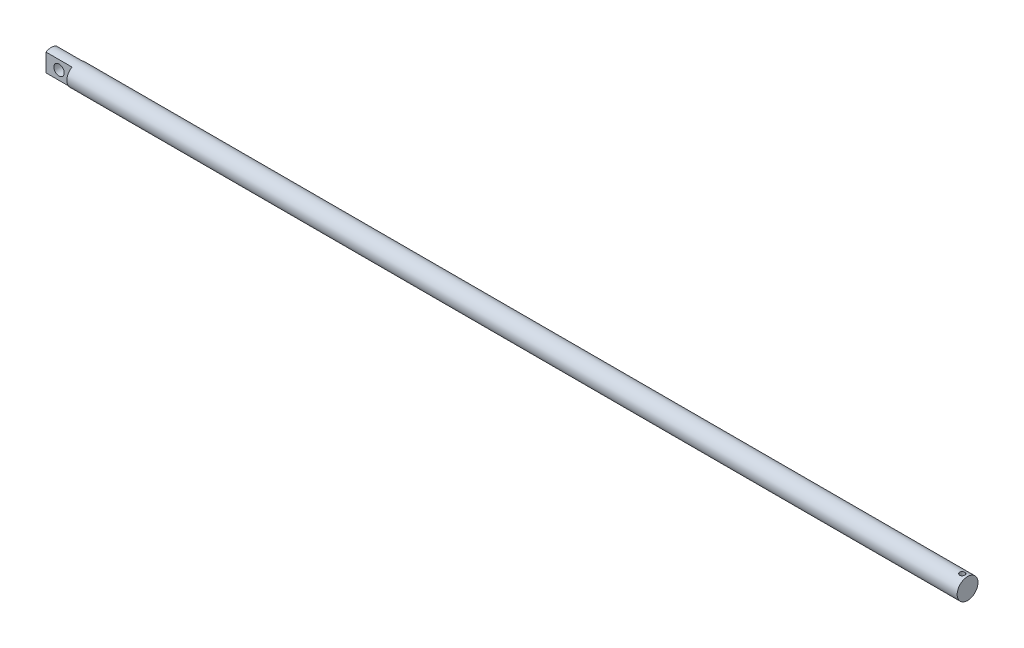
ISO-10303-21;
HEADER;
FILE_DESCRIPTION(('STEP AP214'),'2;1');
FILE_NAME('part.step','',(''),(''),'','','');
FILE_SCHEMA(('AUTOMOTIVE_DESIGN { 1 0 10303 214 1 1 1 1 }'));
ENDSEC;
DATA;
#1=APPLICATION_CONTEXT('core data for automotive mechanical design processes');
#2=APPLICATION_PROTOCOL_DEFINITION('international standard','automotive_design',2000,#1);
#3=PRODUCT_CONTEXT('',#1,'mechanical');
#4=PRODUCT('Part','Part','',(#3));
#5=PRODUCT_RELATED_PRODUCT_CATEGORY('part','',(#4));
#6=PRODUCT_DEFINITION_FORMATION('','',#4);
#7=PRODUCT_DEFINITION_CONTEXT('part definition',#1,'design');
#8=PRODUCT_DEFINITION('design','',#6,#7);
#9=PRODUCT_DEFINITION_SHAPE('','',#8);
#10=(LENGTH_UNIT() NAMED_UNIT(*) SI_UNIT(.MILLI.,.METRE.));
#11=(NAMED_UNIT(*) PLANE_ANGLE_UNIT() SI_UNIT($,.RADIAN.));
#12=(NAMED_UNIT(*) SI_UNIT($,.STERADIAN.) SOLID_ANGLE_UNIT());
#13=UNCERTAINTY_MEASURE_WITH_UNIT(LENGTH_MEASURE(1.E-05),#10,'distance_accuracy_value','');
#14=(GEOMETRIC_REPRESENTATION_CONTEXT(3) GLOBAL_UNCERTAINTY_ASSIGNED_CONTEXT((#13)) GLOBAL_UNIT_ASSIGNED_CONTEXT((#10,
#11,#12)) REPRESENTATION_CONTEXT('',''));
#15=CARTESIAN_POINT('',(0.,0.,0.));
#16=DIRECTION('',(0.,0.,1.));
#17=DIRECTION('',(1.,0.,0.));
#18=AXIS2_PLACEMENT_3D('',#15,#16,#17);
#19=CARTESIAN_POINT('',(703.5,0.,0.));
#20=DIRECTION('',(-1.,0.,0.));
#21=DIRECTION('',(0.,0.,1.));
#22=AXIS2_PLACEMENT_3D('',#19,#20,#21);
#23=CYLINDRICAL_SURFACE('',#22,8.);
#24=CARTESIAN_POINT('',(699.5,-7.74596669241483,2.));
#25=CARTESIAN_POINT('',(699.610440600741,-7.74596880070288,1.99999686287446));
#26=CARTESIAN_POINT('',(699.720915918943,-7.74835444811678,1.99082099639812));
#27=CARTESIAN_POINT('',(699.938694062539,-7.75761489594051,1.95441850037102));
#28=CARTESIAN_POINT('',(700.045995003575,-7.76449230897304,1.92718136539367));
#29=CARTESIAN_POINT('',(700.25424283055,-7.78190979676921,1.85559295970561));
#30=CARTESIAN_POINT('',(700.355197724309,-7.79244514152367,1.81126378228358));
#31=CARTESIAN_POINT('',(700.548248682032,-7.81598553623007,1.70681691300909));
#32=CARTESIAN_POINT('',(700.640344369664,-7.82899069102792,1.64669855084853));
#33=CARTESIAN_POINT('',(700.81508931621,-7.856325730845,1.51096674184948));
#34=CARTESIAN_POINT('',(700.89751488028,-7.87067678098428,1.43506951016321));
#35=CARTESIAN_POINT('',(701.048609115488,-7.89890300412235,1.2705456512805));
#36=CARTESIAN_POINT('',(701.117276500497,-7.91277813253111,1.18191783534422));
#37=CARTESIAN_POINT('',(701.239820374105,-7.93872332416467,0.992916160863108));
#38=CARTESIAN_POINT('',(701.293477110529,-7.95076549920475,0.892395660956012));
#39=CARTESIAN_POINT('',(701.383047715323,-7.97144649540788,0.683410547434112));
#40=CARTESIAN_POINT('',(701.418964201532,-7.98008581867476,0.57494710863347));
#41=CARTESIAN_POINT('',(701.471318267663,-7.99283807078545,0.355487007003265));
#42=CARTESIAN_POINT('',(701.488135715461,-7.99703915075452,0.244586175639118));
#43=CARTESIAN_POINT('',(701.503006703421,-8.00074875285838,0.0214630554101571));
#44=CARTESIAN_POINT('',(701.501063017768,-8.00025796877363,-0.090759035630511));
#45=CARTESIAN_POINT('',(701.4787401198,-7.99470475962828,-0.310704494344816));
#46=CARTESIAN_POINT('',(701.458770939957,-7.98974401872699,-0.418472431202162));
#47=CARTESIAN_POINT('',(701.401622983961,-7.97592669219883,-0.629076494827399));
#48=CARTESIAN_POINT('',(701.364443291698,-7.96706989918752,-0.731912358740913));
#49=CARTESIAN_POINT('',(701.27359794345,-7.94630007760716,-0.930813407003668));
#50=CARTESIAN_POINT('',(701.21978636427,-7.93436015756042,-1.02680901953307));
#51=CARTESIAN_POINT('',(701.097315456707,-7.90871923047719,-1.20855124468102));
#52=CARTESIAN_POINT('',(701.028653545151,-7.89501791721992,-1.29429607017104));
#53=CARTESIAN_POINT('',(700.876233006414,-7.86690971015616,-1.45554807016992));
#54=CARTESIAN_POINT('',(700.792116086122,-7.85249375620734,-1.53071535815041));
#55=CARTESIAN_POINT('',(700.612320021168,-7.82492034813365,-1.66595275192605));
#56=CARTESIAN_POINT('',(700.516640336407,-7.81176295284776,-1.72602215209205));
#57=CARTESIAN_POINT('',(700.315767972681,-7.78816397465319,-1.8295762580452));
#58=CARTESIAN_POINT('',(700.21053141575,-7.77773586980577,-1.87297913394097));
#59=CARTESIAN_POINT('',(699.993931625539,-7.76094912111966,-1.94137124127267));
#60=CARTESIAN_POINT('',(699.882569708814,-7.75458960648175,-1.96636441310581));
#61=CARTESIAN_POINT('',(699.660032398782,-7.74684284831313,-1.99666371093212));
#62=CARTESIAN_POINT('',(699.548929765336,-7.74532871274919,-2.00247237913569));
#63=CARTESIAN_POINT('',(699.327342450738,-7.74709874784831,-1.99561359241245));
#64=CARTESIAN_POINT('',(699.216857713639,-7.75038247681012,-1.98294783827906));
#65=CARTESIAN_POINT('',(699.001508588036,-7.76125665563648,-1.93994037115014));
#66=CARTESIAN_POINT('',(698.896581818743,-7.768775761875,-1.90989125462541));
#67=CARTESIAN_POINT('',(698.693254833719,-7.78720574616769,-1.83329446533651));
#68=CARTESIAN_POINT('',(698.594855392756,-7.7981170259889,-1.78674483817005));
#69=CARTESIAN_POINT('',(698.405246977706,-7.8223690967461,-1.67741653434925));
#70=CARTESIAN_POINT('',(698.314216927966,-7.83575334885313,-1.61433740306851));
#71=CARTESIAN_POINT('',(698.143849309759,-7.86333666457372,-1.47412058586894));
#72=CARTESIAN_POINT('',(698.06451366668,-7.87753586182776,-1.39698058961091));
#73=CARTESIAN_POINT('',(697.917751165943,-7.90557922425284,-1.22852544196949));
#74=CARTESIAN_POINT('',(697.850671949961,-7.91940561649468,-1.13690390506325));
#75=CARTESIAN_POINT('',(697.732851306439,-7.94477773290987,-0.943405365389386));
#76=CARTESIAN_POINT('',(697.682109026713,-7.95632357603169,-0.841528897915166));
#77=CARTESIAN_POINT('',(697.598843172378,-7.97576092590651,-0.631116403462118));
#78=CARTESIAN_POINT('',(697.566188572497,-7.98367864017925,-0.522634762055708));
#79=CARTESIAN_POINT('',(697.519631732313,-7.99508234716634,-0.30149952063757));
#80=CARTESIAN_POINT('',(697.505725873009,-7.99856919514738,-0.188846730082443));
#81=CARTESIAN_POINT('',(697.497264820849,-8.00068338817612,0.0341670528866805));
#82=CARTESIAN_POINT('',(697.502196581809,-7.99943957759977,0.144507653932079));
#83=CARTESIAN_POINT('',(697.530095654589,-7.99251792914887,0.362734992829535));
#84=CARTESIAN_POINT('',(697.553062430026,-7.98684022314338,0.470621803561887));
#85=CARTESIAN_POINT('',(697.616104439542,-7.97170865707778,0.680342071289571));
#86=CARTESIAN_POINT('',(697.656086906629,-7.96227529004785,0.782204989161745));
#87=CARTESIAN_POINT('',(697.751941158039,-7.94062577827316,0.97783410608327));
#88=CARTESIAN_POINT('',(697.807814945341,-7.92840928277515,1.07159928253129));
#89=CARTESIAN_POINT('',(697.935430467992,-7.90214499360574,1.25080385684663));
#90=CARTESIAN_POINT('',(698.007520285808,-7.88806033883329,1.33598997659669));
#91=CARTESIAN_POINT('',(698.164845703955,-7.85981298114379,1.49323004054702));
#92=CARTESIAN_POINT('',(698.250084632222,-7.84565025934604,1.56528065015319));
#93=CARTESIAN_POINT('',(698.433202828379,-7.81854951691004,1.6955240529437));
#94=CARTESIAN_POINT('',(698.531288246731,-7.80563927346576,1.75343323883282));
#95=CARTESIAN_POINT('',(698.73611097975,-7.78287910989655,1.851853793171));
#96=CARTESIAN_POINT('',(698.842841932188,-7.77302696466427,1.89237781950433));
#97=CARTESIAN_POINT('',(699.04115402367,-7.75903817501474,1.948845057142));
#98=CARTESIAN_POINT('',(699.131786328772,-7.75417326006998,1.96798634119375));
#99=CARTESIAN_POINT('',(699.314937737995,-7.7476367716524,1.99356458514353));
#100=CARTESIAN_POINT('',(699.407456680489,-7.74596492578216,2.0000026287435));
#101=CARTESIAN_POINT('',(699.5,-7.74596669241483,2.));
#102=B_SPLINE_CURVE_WITH_KNOTS('',3,(#24,#25,#26,#27,#28,#29,#30,#31,#32,#33,#34,#35,#36,#37,
#38,#39,#40,#41,#42,#43,#44,#45,#46,#47,#48,#49,#50,#51,#52,#53,#54,#55,#56,#57,#58,#59,#60,#61,
#62,#63,#64,#65,#66,#67,#68,#69,#70,#71,#72,#73,#74,#75,#76,#77,#78,#79,#80,#81,#82,#83,#84,#85,
#86,#87,#88,#89,#90,#91,#92,#93,#94,#95,#96,#97,#98,#99,#100,#101),.UNSPECIFIED.,.T.,.F.,(4,2,2,
2,2,2,2,2,2,2,2,2,2,2,2,2,2,2,2,2,2,2,2,2,2,2,2,2,2,2,2,2,2,2,2,2,2,2,4),(0.,0.330981953388986,
0.662156593142972,0.992904581732821,1.32366661404383,1.66099163354378,1.99834817183898,
2.34041197118344,2.68242527877679,3.01751000796282,3.3525451893282,3.6801461015116,
4.00776445379832,4.33834299403564,4.66897908375136,5.00856373257526,5.3481642495984,
5.68941145606711,6.03058560103631,6.36274859809358,6.69488101747034,7.02157924007352,
7.34831617137137,7.68146276687315,8.01466415108029,8.35620264772246,8.69772332575646,
9.03673658245546,9.37568439127232,9.70546756901967,10.0352409390159,10.3632390124777,
10.6912784459046,11.0271767726566,11.3631602525241,11.7054118182896,12.0474137709606,
12.3247826174462,12.6021278008237),.UNSPECIFIED.);
#103=CARTESIAN_POINT('',(699.5,-7.74596669241483,2.));
#104=VERTEX_POINT('',#103);
#105=EDGE_CURVE('E41',#104,#104,#102,.T.);
#106=ORIENTED_EDGE('',*,*,#105,.T.);
#107=EDGE_LOOP('',(#106));
#108=FACE_BOUND('',#107,.T.);
#109=CARTESIAN_POINT('',(699.5,7.74596669241483,2.));
#110=CARTESIAN_POINT('',(699.389559399259,7.74596880070288,1.99999686287446));
#111=CARTESIAN_POINT('',(699.279084081057,7.74835444811678,1.99082099639812));
#112=CARTESIAN_POINT('',(699.061305937461,7.75761489594051,1.95441850037102));
#113=CARTESIAN_POINT('',(698.954004996426,7.76449230897305,1.92718136539366));
#114=CARTESIAN_POINT('',(698.74575716945,7.7819097967692,1.85559295970564));
#115=CARTESIAN_POINT('',(698.644802275692,7.79244514152365,1.81126378228364));
#116=CARTESIAN_POINT('',(698.451751317968,7.81598553623006,1.70681691300917));
#117=CARTESIAN_POINT('',(698.359655630336,7.82899069102791,1.64669855084857));
#118=CARTESIAN_POINT('',(698.18491068379,7.85632573084501,1.51096674184947));
#119=CARTESIAN_POINT('',(698.10248511972,7.87067678098428,1.43506951016321));
#120=CARTESIAN_POINT('',(697.951390884512,7.89890300412235,1.2705456512805));
#121=CARTESIAN_POINT('',(697.882723499503,7.91277813253111,1.18191783534422));
#122=CARTESIAN_POINT('',(697.760179625895,7.93872332416467,0.992916160863119));
#123=CARTESIAN_POINT('',(697.706522889471,7.95076549920475,0.89239566095604));
#124=CARTESIAN_POINT('',(697.616952284678,7.97144649540787,0.683410547434142));
#125=CARTESIAN_POINT('',(697.581035798468,7.98008581867476,0.574947108633484));
#126=CARTESIAN_POINT('',(697.528681732337,7.99283807078545,0.355487007003263));
#127=CARTESIAN_POINT('',(697.511864284539,7.99703915075452,0.244586175639117));
#128=CARTESIAN_POINT('',(697.49699329658,8.00074875285838,0.0214630554101577));
#129=CARTESIAN_POINT('',(697.498936982232,8.00025796877363,-0.0907590356305105));
#130=CARTESIAN_POINT('',(697.5212598802,7.99470475962828,-0.310704494344825));
#131=CARTESIAN_POINT('',(697.541229060043,7.98974401872699,-0.418472431202182));
#132=CARTESIAN_POINT('',(697.598377016039,7.97592669219883,-0.629076494827418));
#133=CARTESIAN_POINT('',(697.635556708302,7.96706989918752,-0.731912358740921));
#134=CARTESIAN_POINT('',(697.72640205655,7.94630007760716,-0.930813407003667));
#135=CARTESIAN_POINT('',(697.78021363573,7.93436015756042,-1.02680901953307));
#136=CARTESIAN_POINT('',(697.902684543293,7.90871923047719,-1.20855124468102));
#137=CARTESIAN_POINT('',(697.971346454849,7.89501791721992,-1.29429607017104));
#138=CARTESIAN_POINT('',(698.123766993586,7.86690971015616,-1.45554807016992));
#139=CARTESIAN_POINT('',(698.207883913878,7.85249375620734,-1.53071535815041));
#140=CARTESIAN_POINT('',(698.387679978832,7.82492034813365,-1.66595275192605));
#141=CARTESIAN_POINT('',(698.483359663593,7.81176295284776,-1.72602215209205));
#142=CARTESIAN_POINT('',(698.684232027319,7.78816397465319,-1.8295762580452));
#143=CARTESIAN_POINT('',(698.78946858425,7.77773586980577,-1.87297913394097));
#144=CARTESIAN_POINT('',(699.006068374461,7.76094912111966,-1.94137124127267));
#145=CARTESIAN_POINT('',(699.117430291186,7.75458960648175,-1.96636441310581));
#146=CARTESIAN_POINT('',(699.339967601218,7.74684284831313,-1.99666371093212));
#147=CARTESIAN_POINT('',(699.451070234664,7.74532871274919,-2.00247237913569));
#148=CARTESIAN_POINT('',(699.672657549262,7.74709874784831,-1.99561359241245));
#149=CARTESIAN_POINT('',(699.783142286361,7.75038247681012,-1.98294783827905));
#150=CARTESIAN_POINT('',(699.998491411964,7.76125665563648,-1.93994037115014));
#151=CARTESIAN_POINT('',(700.103418181257,7.768775761875,-1.90989125462539));
#152=CARTESIAN_POINT('',(700.306745166281,7.7872057461677,-1.83329446533648));
#153=CARTESIAN_POINT('',(700.405144607244,7.79811702598891,-1.78674483817003));
#154=CARTESIAN_POINT('',(700.594753022294,7.8223690967461,-1.67741653434925));
#155=CARTESIAN_POINT('',(700.685783072034,7.83575334885313,-1.61433740306851));
#156=CARTESIAN_POINT('',(700.856150690241,7.86333666457372,-1.47412058586894));
#157=CARTESIAN_POINT('',(700.93548633332,7.87753586182776,-1.3969805896109));
#158=CARTESIAN_POINT('',(701.082248834057,7.90557922425285,-1.22852544196945));
#159=CARTESIAN_POINT('',(701.149328050039,7.91940561649469,-1.13690390506316));
#160=CARTESIAN_POINT('',(701.267148693561,7.94477773290988,-0.943405365389286));
#161=CARTESIAN_POINT('',(701.317890973287,7.9563235760317,-0.841528897915112));
#162=CARTESIAN_POINT('',(701.401156827622,7.97576092590651,-0.631116403462116));
#163=CARTESIAN_POINT('',(701.433811427503,7.98367864017925,-0.522634762055708));
#164=CARTESIAN_POINT('',(701.480368267687,7.99508234716634,-0.301499520637571));
#165=CARTESIAN_POINT('',(701.494274126991,7.99856919514738,-0.188846730082443));
#166=CARTESIAN_POINT('',(701.502735179151,8.00068338817612,0.0341670528866806));
#167=CARTESIAN_POINT('',(701.497803418191,7.99943957759977,0.144507653932079));
#168=CARTESIAN_POINT('',(701.469904345411,7.99251792914887,0.362734992829535));
#169=CARTESIAN_POINT('',(701.446937569974,7.98684022314338,0.470621803561887));
#170=CARTESIAN_POINT('',(701.383895560458,7.97170865707778,0.680342071289571));
#171=CARTESIAN_POINT('',(701.343913093371,7.96227529004785,0.782204989161745));
#172=CARTESIAN_POINT('',(701.248058841961,7.94062577827316,0.97783410608327));
#173=CARTESIAN_POINT('',(701.192185054659,7.92840928277515,1.07159928253129));
#174=CARTESIAN_POINT('',(701.064569532008,7.90214499360574,1.25080385684663));
#175=CARTESIAN_POINT('',(700.992479714192,7.88806033883329,1.33598997659669));
#176=CARTESIAN_POINT('',(700.835154296045,7.85981298114379,1.49323004054702));
#177=CARTESIAN_POINT('',(700.749915367778,7.84565025934604,1.56528065015319));
#178=CARTESIAN_POINT('',(700.566797171621,7.81854951691004,1.6955240529437));
#179=CARTESIAN_POINT('',(700.468711753269,7.80563927346576,1.75343323883282));
#180=CARTESIAN_POINT('',(700.26388902025,7.78287910989655,1.851853793171));
#181=CARTESIAN_POINT('',(700.157158067812,7.77302696466427,1.89237781950433));
#182=CARTESIAN_POINT('',(699.95884597633,7.75903817501474,1.948845057142));
#183=CARTESIAN_POINT('',(699.868213671228,7.75417326006998,1.96798634119375));
#184=CARTESIAN_POINT('',(699.685062262005,7.7476367716524,1.99356458514353));
#185=CARTESIAN_POINT('',(699.592543319511,7.74596492578216,2.00000262874349));
#186=CARTESIAN_POINT('',(699.5,7.74596669241483,2.));
#187=B_SPLINE_CURVE_WITH_KNOTS('',3,(#109,#110,#111,#112,#113,#114,#115,#116,#117,#118,#119,
#120,#121,#122,#123,#124,#125,#126,#127,#128,#129,#130,#131,#132,#133,#134,#135,#136,#137,#138,
#139,#140,#141,#142,#143,#144,#145,#146,#147,#148,#149,#150,#151,#152,#153,#154,#155,#156,#157,
#158,#159,#160,#161,#162,#163,#164,#165,#166,#167,#168,#169,#170,#171,#172,#173,#174,#175,#176,
#177,#178,#179,#180,#181,#182,#183,#184,#185,#186),.UNSPECIFIED.,.T.,.F.,(4,2,2,2,2,2,2,2,2,2,2,
2,2,2,2,2,2,2,2,2,2,2,2,2,2,2,2,2,2,2,2,2,2,2,2,2,2,2,4),(0.,0.330981953388986,
0.662156593142972,0.992904581732681,1.32366661404384,1.66099163354379,1.99834817183899,
2.34041197118341,2.6824252787768,3.01751000796283,3.35254518932821,3.68014610151164,
4.00776445379833,4.33834299403565,4.66897908375137,5.00856373257527,5.34816424959841,
5.68941145606712,6.03058560103632,6.36274859809358,6.69488101747035,7.02157924007364,
7.34831617137138,7.68146276687316,8.0146641510803,8.35620264772266,8.69772332575647,
9.03673658245547,9.37568439127233,9.70546756901968,10.0352409390159,10.3632390124777,
10.6912784459046,11.0271767726566,11.3631602525241,11.7054118182896,12.0474137709606,
12.3247826174462,12.6021278008238),.UNSPECIFIED.);
#188=CARTESIAN_POINT('',(699.5,7.74596669241483,2.));
#189=VERTEX_POINT('',#188);
#190=EDGE_CURVE('E113',#189,#189,#187,.T.);
#191=ORIENTED_EDGE('',*,*,#190,.T.);
#192=EDGE_LOOP('',(#191));
#193=FACE_BOUND('',#192,.T.);
#194=CARTESIAN_POINT('',(703.5,0.,0.));
#195=DIRECTION('',(1.,0.,0.));
#196=DIRECTION('',(0.,0.,-1.));
#197=AXIS2_PLACEMENT_3D('',#194,#195,#196);
#198=CIRCLE('',#197,8.);
#199=CARTESIAN_POINT('',(703.5,0.,-8.));
#200=VERTEX_POINT('',#199);
#201=EDGE_CURVE('E100',#200,#200,#198,.T.);
#202=ORIENTED_EDGE('',*,*,#201,.F.);
#203=EDGE_LOOP('',(#202));
#204=FACE_BOUND('',#203,.T.);
#205=DIRECTION('',(-1.,0.,0.));
#206=VECTOR('',#205,1.);
#207=CARTESIAN_POINT('',(703.5,6.92820323027551,4.));
#208=LINE('',#207,#206);
#209=CARTESIAN_POINT('',(20.,6.92820323027551,4.));
#210=VERTEX_POINT('',#209);
#211=CARTESIAN_POINT('',(0.,6.92820323027551,4.));
#212=VERTEX_POINT('',#211);
#213=EDGE_CURVE('E65',#210,#212,#208,.T.);
#214=ORIENTED_EDGE('',*,*,#213,.F.);
#215=CARTESIAN_POINT('',(20.,0.,0.));
#216=DIRECTION('',(-1.,0.,0.));
#217=DIRECTION('',(0.,0.,1.));
#218=AXIS2_PLACEMENT_3D('',#215,#216,#217);
#219=CIRCLE('',#218,8.);
#220=CARTESIAN_POINT('',(20.,-6.92820323027551,4.));
#221=VERTEX_POINT('',#220);
#222=EDGE_CURVE('E12',#221,#210,#219,.T.);
#223=ORIENTED_EDGE('',*,*,#222,.F.);
#224=DIRECTION('',(-1.,0.,0.));
#225=VECTOR('',#224,1.);
#226=CARTESIAN_POINT('',(703.5,-6.92820323027551,4.));
#227=LINE('',#226,#225);
#228=CARTESIAN_POINT('',(0.,-6.92820323027551,4.));
#229=VERTEX_POINT('',#228);
#230=EDGE_CURVE('E112',#229,#221,#227,.F.);
#231=ORIENTED_EDGE('',*,*,#230,.F.);
#232=CARTESIAN_POINT('',(0.,0.,0.));
#233=DIRECTION('',(1.,0.,0.));
#234=DIRECTION('',(0.,0.,-1.));
#235=AXIS2_PLACEMENT_3D('',#232,#233,#234);
#236=CIRCLE('',#235,8.);
#237=CARTESIAN_POINT('',(0.,-6.92820323027551,-4.));
#238=VERTEX_POINT('',#237);
#239=EDGE_CURVE('E101',#229,#238,#236,.T.);
#240=ORIENTED_EDGE('',*,*,#239,.T.);
#241=DIRECTION('',(-1.,0.,0.));
#242=VECTOR('',#241,1.);
#243=CARTESIAN_POINT('',(703.5,-6.92820323027551,-4.));
#244=LINE('',#243,#242);
#245=CARTESIAN_POINT('',(20.,-6.92820323027551,-4.));
#246=VERTEX_POINT('',#245);
#247=EDGE_CURVE('E57',#246,#238,#244,.T.);
#248=ORIENTED_EDGE('',*,*,#247,.F.);
#249=CARTESIAN_POINT('',(20.,6.92820323027551,-4.));
#250=VERTEX_POINT('',#249);
#251=EDGE_CURVE('E49',#250,#246,#219,.T.);
#252=ORIENTED_EDGE('',*,*,#251,.F.);
#253=DIRECTION('',(-1.,0.,0.));
#254=VECTOR('',#253,1.);
#255=CARTESIAN_POINT('',(703.5,6.92820323027551,-4.));
#256=LINE('',#255,#254);
#257=CARTESIAN_POINT('',(0.,6.92820323027551,-4.));
#258=VERTEX_POINT('',#257);
#259=EDGE_CURVE('E84',#258,#250,#256,.F.);
#260=ORIENTED_EDGE('',*,*,#259,.F.);
#261=EDGE_CURVE('E96',#258,#212,#236,.T.);
#262=ORIENTED_EDGE('',*,*,#261,.T.);
#263=EDGE_LOOP('',(#214,#223,#231,#240,#248,#252,#260,#262));
#264=FACE_BOUND('',#263,.T.);
#265=ADVANCED_FACE('F37',(#108,#193,#204,#264),#23,.T.);
#266=CARTESIAN_POINT('',(0.,0.,0.));
#267=DIRECTION('',(1.,0.,0.));
#268=DIRECTION('',(0.,0.,-1.));
#269=AXIS2_PLACEMENT_3D('',#266,#267,#268);
#270=PLANE('',#269);
#271=DIRECTION('',(0.,1.,0.));
#272=VECTOR('',#271,1.);
#273=CARTESIAN_POINT('',(0.,10.,4.));
#274=LINE('',#273,#272);
#275=EDGE_CURVE('E91',#229,#212,#274,.T.);
#276=ORIENTED_EDGE('',*,*,#275,.T.);
#277=ORIENTED_EDGE('',*,*,#261,.F.);
#278=DIRECTION('',(0.,-1.,0.));
#279=VECTOR('',#278,1.);
#280=CARTESIAN_POINT('',(0.,10.,-4.));
#281=LINE('',#280,#279);
#282=EDGE_CURVE('E81',#258,#238,#281,.T.);
#283=ORIENTED_EDGE('',*,*,#282,.T.);
#284=ORIENTED_EDGE('',*,*,#239,.F.);
#285=EDGE_LOOP('',(#276,#277,#283,#284));
#286=FACE_BOUND('',#285,.T.);
#287=ADVANCED_FACE('F99',(#286),#270,.F.);
#288=CARTESIAN_POINT('',(703.5,0.,0.));
#289=DIRECTION('',(1.,0.,0.));
#290=DIRECTION('',(0.,0.,-1.));
#291=AXIS2_PLACEMENT_3D('',#288,#289,#290);
#292=PLANE('',#291);
#293=ORIENTED_EDGE('',*,*,#201,.T.);
#294=EDGE_LOOP('',(#293));
#295=FACE_BOUND('',#294,.T.);
#296=ADVANCED_FACE('F127',(#295),#292,.T.);
#297=CARTESIAN_POINT('',(20.,10.,-4.));
#298=DIRECTION('',(0.,0.,-1.));
#299=DIRECTION('',(0.,1.,0.));
#300=AXIS2_PLACEMENT_3D('',#297,#298,#299);
#301=PLANE('',#300);
#302=CARTESIAN_POINT('',(10.,0.,-4.));
#303=DIRECTION('',(0.,0.,-1.));
#304=DIRECTION('',(0.,1.,0.));
#305=AXIS2_PLACEMENT_3D('',#302,#303,#304);
#306=CIRCLE('',#305,4.);
#307=CARTESIAN_POINT('',(10.,4.,-4.));
#308=VERTEX_POINT('',#307);
#309=EDGE_CURVE('E97',#308,#308,#306,.F.);
#310=ORIENTED_EDGE('',*,*,#309,.T.);
#311=EDGE_LOOP('',(#310));
#312=FACE_BOUND('',#311,.T.);
#313=ORIENTED_EDGE('',*,*,#247,.T.);
#314=ORIENTED_EDGE('',*,*,#282,.F.);
#315=ORIENTED_EDGE('',*,*,#259,.T.);
#316=DIRECTION('',(0.,-1.,0.));
#317=VECTOR('',#316,1.);
#318=CARTESIAN_POINT('',(20.,10.,-4.));
#319=LINE('',#318,#317);
#320=EDGE_CURVE('E109',#250,#246,#319,.T.);
#321=ORIENTED_EDGE('',*,*,#320,.T.);
#322=EDGE_LOOP('',(#313,#314,#315,#321));
#323=FACE_BOUND('',#322,.T.);
#324=ADVANCED_FACE('F83',(#312,#323),#301,.T.);
#325=CARTESIAN_POINT('',(20.,0.,0.));
#326=DIRECTION('',(-1.,0.,0.));
#327=DIRECTION('',(0.,0.,1.));
#328=AXIS2_PLACEMENT_3D('',#325,#326,#327);
#329=PLANE('',#328);
#330=ORIENTED_EDGE('',*,*,#251,.T.);
#331=ORIENTED_EDGE('',*,*,#320,.F.);
#332=EDGE_LOOP('',(#330,#331));
#333=FACE_BOUND('',#332,.T.);
#334=ADVANCED_FACE('F126',(#333),#329,.T.);
#335=ORIENTED_EDGE('',*,*,#222,.T.);
#336=DIRECTION('',(0.,1.,0.));
#337=VECTOR('',#336,1.);
#338=CARTESIAN_POINT('',(20.,10.,4.));
#339=LINE('',#338,#337);
#340=EDGE_CURVE('E90',#221,#210,#339,.T.);
#341=ORIENTED_EDGE('',*,*,#340,.F.);
#342=EDGE_LOOP('',(#335,#341));
#343=FACE_BOUND('',#342,.T.);
#344=ADVANCED_FACE('F132',(#343),#329,.T.);
#345=CARTESIAN_POINT('',(20.,10.,4.));
#346=DIRECTION('',(0.,0.,1.));
#347=DIRECTION('',(0.,-1.,0.));
#348=AXIS2_PLACEMENT_3D('',#345,#346,#347);
#349=PLANE('',#348);
#350=CARTESIAN_POINT('',(10.,0.,4.));
#351=DIRECTION('',(0.,0.,1.));
#352=DIRECTION('',(0.,-1.,0.));
#353=AXIS2_PLACEMENT_3D('',#350,#351,#352);
#354=CIRCLE('',#353,4.);
#355=CARTESIAN_POINT('',(10.,-4.,4.));
#356=VERTEX_POINT('',#355);
#357=EDGE_CURVE('E110',#356,#356,#354,.F.);
#358=ORIENTED_EDGE('',*,*,#357,.T.);
#359=EDGE_LOOP('',(#358));
#360=FACE_BOUND('',#359,.T.);
#361=ORIENTED_EDGE('',*,*,#213,.T.);
#362=ORIENTED_EDGE('',*,*,#275,.F.);
#363=ORIENTED_EDGE('',*,*,#230,.T.);
#364=ORIENTED_EDGE('',*,*,#340,.T.);
#365=EDGE_LOOP('',(#361,#362,#363,#364));
#366=FACE_BOUND('',#365,.T.);
#367=ADVANCED_FACE('F129',(#360,#366),#349,.T.);
#368=CARTESIAN_POINT('',(10.,0.,-8.));
#369=DIRECTION('',(0.,0.,1.));
#370=DIRECTION('',(1.,0.,0.));
#371=AXIS2_PLACEMENT_3D('',#368,#369,#370);
#372=CYLINDRICAL_SURFACE('',#371,4.);
#373=ORIENTED_EDGE('',*,*,#309,.F.);
#374=EDGE_LOOP('',(#373));
#375=FACE_BOUND('',#374,.T.);
#376=ORIENTED_EDGE('',*,*,#357,.F.);
#377=EDGE_LOOP('',(#376));
#378=FACE_BOUND('',#377,.T.);
#379=ADVANCED_FACE('F121',(#375,#378),#372,.F.);
#380=CARTESIAN_POINT('',(699.5,-25.,0.));
#381=DIRECTION('',(0.,1.,0.));
#382=DIRECTION('',(0.,0.,1.));
#383=AXIS2_PLACEMENT_3D('',#380,#381,#382);
#384=CYLINDRICAL_SURFACE('',#383,2.);
#385=ORIENTED_EDGE('',*,*,#190,.F.);
#386=EDGE_LOOP('',(#385));
#387=FACE_BOUND('',#386,.T.);
#388=ORIENTED_EDGE('',*,*,#105,.F.);
#389=EDGE_LOOP('',(#388));
#390=FACE_BOUND('',#389,.T.);
#391=ADVANCED_FACE('F117',(#387,#390),#384,.F.);
#392=CLOSED_SHELL('',(#265,#287,#296,#324,#334,#344,#367,#379,#391));
#393=MANIFOLD_SOLID_BREP('B2',#392);
#394=ADVANCED_BREP_SHAPE_REPRESENTATION('',(#18,#393),#14);
#395=SHAPE_DEFINITION_REPRESENTATION(#9,#394);
ENDSEC;
END-ISO-10303-21;
